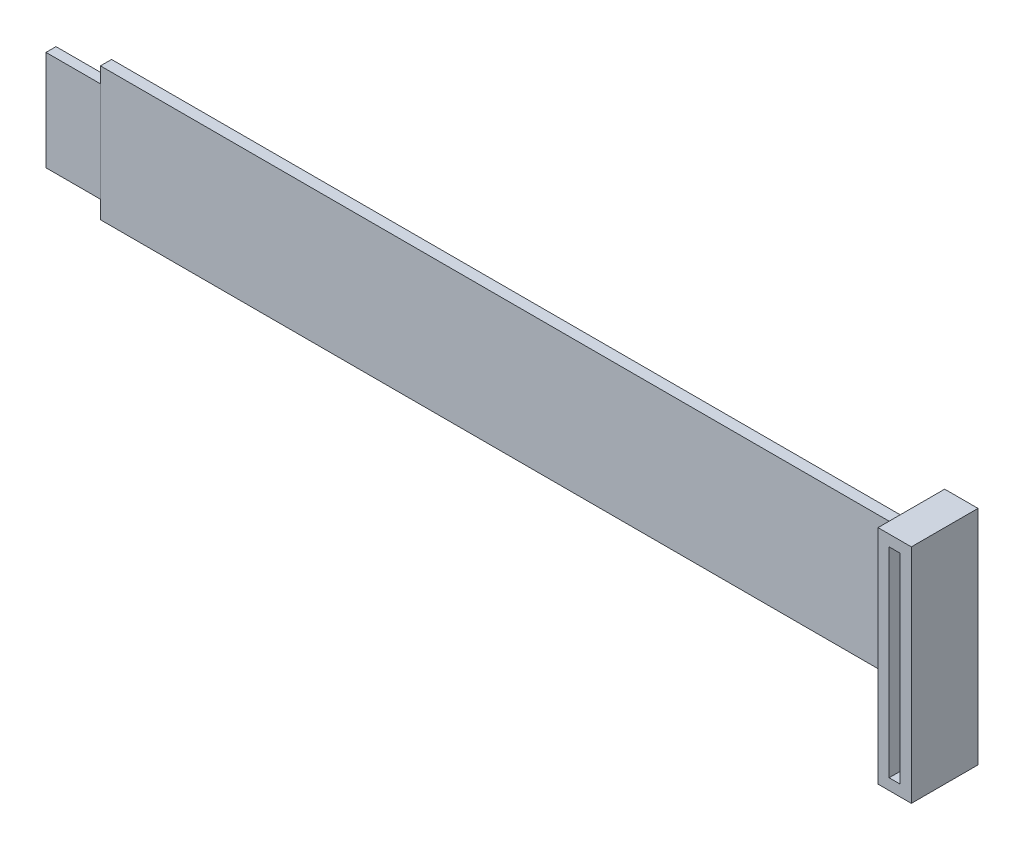
ISO-10303-21;
HEADER;
FILE_DESCRIPTION(('STEP AP214'),'2;1');
FILE_NAME('part.step','',(''),(''),'','','');
FILE_SCHEMA(('AUTOMOTIVE_DESIGN { 1 0 10303 214 1 1 1 1 }'));
ENDSEC;
DATA;
#1=APPLICATION_CONTEXT('core data for automotive mechanical design processes');
#2=APPLICATION_PROTOCOL_DEFINITION('international standard','automotive_design',2000,#1);
#3=PRODUCT_CONTEXT('',#1,'mechanical');
#4=PRODUCT('Part','Part','',(#3));
#5=PRODUCT_RELATED_PRODUCT_CATEGORY('part','',(#4));
#6=PRODUCT_DEFINITION_FORMATION('','',#4);
#7=PRODUCT_DEFINITION_CONTEXT('part definition',#1,'design');
#8=PRODUCT_DEFINITION('design','',#6,#7);
#9=PRODUCT_DEFINITION_SHAPE('','',#8);
#10=(LENGTH_UNIT() NAMED_UNIT(*) SI_UNIT(.MILLI.,.METRE.));
#11=(NAMED_UNIT(*) PLANE_ANGLE_UNIT() SI_UNIT($,.RADIAN.));
#12=(NAMED_UNIT(*) SI_UNIT($,.STERADIAN.) SOLID_ANGLE_UNIT());
#13=UNCERTAINTY_MEASURE_WITH_UNIT(LENGTH_MEASURE(1.E-05),#10,'distance_accuracy_value','');
#14=(GEOMETRIC_REPRESENTATION_CONTEXT(3) GLOBAL_UNCERTAINTY_ASSIGNED_CONTEXT((#13)) GLOBAL_UNIT_ASSIGNED_CONTEXT((#10,
#11,#12)) REPRESENTATION_CONTEXT('',''));
#15=CARTESIAN_POINT('',(0.,0.,0.));
#16=DIRECTION('',(0.,0.,1.));
#17=DIRECTION('',(1.,0.,0.));
#18=AXIS2_PLACEMENT_3D('',#15,#16,#17);
#19=CARTESIAN_POINT('',(0.,0.,2.));
#20=DIRECTION('',(0.,0.,-1.));
#21=DIRECTION('',(-1.,0.,0.));
#22=AXIS2_PLACEMENT_3D('',#19,#20,#21);
#23=PLANE('',#22);
#24=DIRECTION('',(-1.,0.,0.));
#25=VECTOR('',#24,1.);
#26=CARTESIAN_POINT('',(1.48345875234823,3.29589632829374,2.));
#27=LINE('',#26,#25);
#28=CARTESIAN_POINT('',(151.483458752348,3.29589632829374,2.));
#29=VERTEX_POINT('',#28);
#30=CARTESIAN_POINT('',(1.48345875234823,3.29589632829374,2.));
#31=VERTEX_POINT('',#30);
#32=EDGE_CURVE('E291',#29,#31,#27,.T.);
#33=ORIENTED_EDGE('',*,*,#32,.T.);
#34=DIRECTION('',(0.,-1.,0.));
#35=VECTOR('',#34,1.);
#36=CARTESIAN_POINT('',(1.48345875234823,-20.7041036717063,2.));
#37=LINE('',#36,#35);
#38=CARTESIAN_POINT('',(1.48345875234823,-20.7041036717063,2.));
#39=VERTEX_POINT('',#38);
#40=EDGE_CURVE('E303',#31,#39,#37,.T.);
#41=ORIENTED_EDGE('',*,*,#40,.T.);
#42=DIRECTION('',(1.,0.,0.));
#43=VECTOR('',#42,1.);
#44=CARTESIAN_POINT('',(151.483458752348,-20.7041036717063,2.));
#45=LINE('',#44,#43);
#46=CARTESIAN_POINT('',(151.483458752348,-20.7041036717063,2.));
#47=VERTEX_POINT('',#46);
#48=EDGE_CURVE('E294',#39,#47,#45,.T.);
#49=ORIENTED_EDGE('',*,*,#48,.T.);
#50=DIRECTION('',(0.,-1.,0.));
#51=VECTOR('',#50,1.);
#52=CARTESIAN_POINT('',(151.483458752348,3.29589632829374,2.));
#53=LINE('',#52,#51);
#54=EDGE_CURVE('E11',#29,#47,#53,.T.);
#55=ORIENTED_EDGE('',*,*,#54,.F.);
#56=EDGE_LOOP('',(#33,#41,#49,#55));
#57=FACE_BOUND('',#56,.T.);
#58=ADVANCED_FACE('F32',(#57),#23,.F.);
#59=CARTESIAN_POINT('',(-8.51654124765177,1.29589632829374,2.));
#60=DIRECTION('',(1.,0.,0.));
#61=DIRECTION('',(0.,1.,0.));
#62=AXIS2_PLACEMENT_3D('',#59,#60,#61);
#63=PLANE('',#62);
#64=DIRECTION('',(0.,0.,1.));
#65=VECTOR('',#64,1.);
#66=CARTESIAN_POINT('',(-8.51654124765177,-17.7041036717063,0.));
#67=LINE('',#66,#65);
#68=CARTESIAN_POINT('',(-8.51654124765177,-17.7041036717063,0.));
#69=VERTEX_POINT('',#68);
#70=CARTESIAN_POINT('',(-8.51654124765177,-17.7041036717063,1.8));
#71=VERTEX_POINT('',#70);
#72=EDGE_CURVE('E161',#69,#71,#67,.T.);
#73=ORIENTED_EDGE('',*,*,#72,.T.);
#74=DIRECTION('',(0.,-1.,0.));
#75=VECTOR('',#74,1.);
#76=CARTESIAN_POINT('',(-8.51654124765177,0.295896328293736,1.8));
#77=LINE('',#76,#75);
#78=CARTESIAN_POINT('',(-8.51654124765177,0.295896328293736,1.8));
#79=VERTEX_POINT('',#78);
#80=EDGE_CURVE('E48',#79,#71,#77,.T.);
#81=ORIENTED_EDGE('',*,*,#80,.F.);
#82=DIRECTION('',(0.,0.,1.));
#83=VECTOR('',#82,1.);
#84=CARTESIAN_POINT('',(-8.51654124765177,0.295896328293736,0.));
#85=LINE('',#84,#83);
#86=CARTESIAN_POINT('',(-8.51654124765177,0.295896328293736,0.));
#87=VERTEX_POINT('',#86);
#88=EDGE_CURVE('E159',#87,#79,#85,.T.);
#89=ORIENTED_EDGE('',*,*,#88,.F.);
#90=DIRECTION('',(0.,-1.,0.));
#91=VECTOR('',#90,1.);
#92=CARTESIAN_POINT('',(-8.51654124765177,1.29589632829374,0.));
#93=LINE('',#92,#91);
#94=EDGE_CURVE('E237',#87,#69,#93,.T.);
#95=ORIENTED_EDGE('',*,*,#94,.T.);
#96=EDGE_LOOP('',(#73,#81,#89,#95));
#97=FACE_BOUND('',#96,.T.);
#98=ADVANCED_FACE('F34',(#97),#63,.F.);
#99=CARTESIAN_POINT('',(151.483458752348,-20.7041036717063,2.));
#100=DIRECTION('',(0.,1.,0.));
#101=DIRECTION('',(0.,0.,1.));
#102=AXIS2_PLACEMENT_3D('',#99,#100,#101);
#103=PLANE('',#102);
#104=DIRECTION('',(1.,0.,0.));
#105=VECTOR('',#104,1.);
#106=CARTESIAN_POINT('',(151.483458752348,-20.7041036717063,0.));
#107=LINE('',#106,#105);
#108=CARTESIAN_POINT('',(1.48345875234823,-20.7041036717063,0.));
#109=VERTEX_POINT('',#108);
#110=CARTESIAN_POINT('',(151.483458752348,-20.7041036717063,0.));
#111=VERTEX_POINT('',#110);
#112=EDGE_CURVE('E280',#109,#111,#107,.T.);
#113=ORIENTED_EDGE('',*,*,#112,.T.);
#114=DIRECTION('',(0.,0.,-1.));
#115=VECTOR('',#114,1.);
#116=CARTESIAN_POINT('',(151.483458752348,-20.7041036717063,2.));
#117=LINE('',#116,#115);
#118=EDGE_CURVE('E269',#47,#111,#117,.T.);
#119=ORIENTED_EDGE('',*,*,#118,.F.);
#120=ORIENTED_EDGE('',*,*,#48,.F.);
#121=DIRECTION('',(0.,0.,-1.));
#122=VECTOR('',#121,1.);
#123=CARTESIAN_POINT('',(1.48345875234823,-20.7041036717063,2.));
#124=LINE('',#123,#122);
#125=EDGE_CURVE('E41',#39,#109,#124,.T.);
#126=ORIENTED_EDGE('',*,*,#125,.T.);
#127=EDGE_LOOP('',(#113,#119,#120,#126));
#128=FACE_BOUND('',#127,.T.);
#129=ADVANCED_FACE('F312',(#128),#103,.F.);
#130=CARTESIAN_POINT('',(1.48345875234823,3.29589632829374,2.));
#131=DIRECTION('',(0.,-1.,0.));
#132=DIRECTION('',(0.,0.,-1.));
#133=AXIS2_PLACEMENT_3D('',#130,#131,#132);
#134=PLANE('',#133);
#135=DIRECTION('',(-1.,0.,0.));
#136=VECTOR('',#135,1.);
#137=CARTESIAN_POINT('',(1.48345875234823,3.29589632829374,0.));
#138=LINE('',#137,#136);
#139=CARTESIAN_POINT('',(151.483458752348,3.29589632829374,0.));
#140=VERTEX_POINT('',#139);
#141=CARTESIAN_POINT('',(1.48345875234823,3.29589632829374,0.));
#142=VERTEX_POINT('',#141);
#143=EDGE_CURVE('E297',#140,#142,#138,.T.);
#144=ORIENTED_EDGE('',*,*,#143,.T.);
#145=DIRECTION('',(0.,0.,-1.));
#146=VECTOR('',#145,1.);
#147=CARTESIAN_POINT('',(1.48345875234823,3.29589632829374,2.));
#148=LINE('',#147,#146);
#149=EDGE_CURVE('E276',#31,#142,#148,.T.);
#150=ORIENTED_EDGE('',*,*,#149,.F.);
#151=ORIENTED_EDGE('',*,*,#32,.F.);
#152=DIRECTION('',(0.,0.,-1.));
#153=VECTOR('',#152,1.);
#154=CARTESIAN_POINT('',(151.483458752348,3.29589632829374,2.));
#155=LINE('',#154,#153);
#156=EDGE_CURVE('E272',#29,#140,#155,.T.);
#157=ORIENTED_EDGE('',*,*,#156,.T.);
#158=EDGE_LOOP('',(#144,#150,#151,#157));
#159=FACE_BOUND('',#158,.T.);
#160=ADVANCED_FACE('F315',(#159),#134,.F.);
#161=CARTESIAN_POINT('',(1.48345875234823,1.29589632829374,2.));
#162=DIRECTION('',(1.,0.,0.));
#163=DIRECTION('',(0.,0.,-1.));
#164=AXIS2_PLACEMENT_3D('',#161,#162,#163);
#165=PLANE('',#164);
#166=DIRECTION('',(0.,-1.,0.));
#167=VECTOR('',#166,1.);
#168=CARTESIAN_POINT('',(1.48345875234823,1.29589632829374,0.));
#169=LINE('',#168,#167);
#170=CARTESIAN_POINT('',(1.48345875234823,0.295896328293736,0.));
#171=VERTEX_POINT('',#170);
#172=EDGE_CURVE('E298',#142,#171,#169,.T.);
#173=ORIENTED_EDGE('',*,*,#172,.T.);
#174=DIRECTION('',(0.,0.,1.));
#175=VECTOR('',#174,1.);
#176=CARTESIAN_POINT('',(1.48345875234823,0.295896328293736,0.));
#177=LINE('',#176,#175);
#178=CARTESIAN_POINT('',(1.48345875234823,0.295896328293736,1.8));
#179=VERTEX_POINT('',#178);
#180=EDGE_CURVE('E166',#171,#179,#177,.T.);
#181=ORIENTED_EDGE('',*,*,#180,.T.);
#182=DIRECTION('',(0.,-1.,0.));
#183=VECTOR('',#182,1.);
#184=CARTESIAN_POINT('',(1.48345875234823,0.295896328293736,1.8));
#185=LINE('',#184,#183);
#186=CARTESIAN_POINT('',(1.48345875234823,-17.7041036717063,1.8));
#187=VERTEX_POINT('',#186);
#188=EDGE_CURVE('E148',#179,#187,#185,.T.);
#189=ORIENTED_EDGE('',*,*,#188,.T.);
#190=DIRECTION('',(0.,0.,1.));
#191=VECTOR('',#190,1.);
#192=CARTESIAN_POINT('',(1.48345875234823,-17.7041036717063,0.));
#193=LINE('',#192,#191);
#194=CARTESIAN_POINT('',(1.48345875234823,-17.7041036717063,0.));
#195=VERTEX_POINT('',#194);
#196=EDGE_CURVE('E525',#195,#187,#193,.T.);
#197=ORIENTED_EDGE('',*,*,#196,.F.);
#198=DIRECTION('',(0.,-1.,0.));
#199=VECTOR('',#198,1.);
#200=CARTESIAN_POINT('',(1.48345875234823,-20.7041036717063,0.));
#201=LINE('',#200,#199);
#202=EDGE_CURVE('E56',#195,#109,#201,.T.);
#203=ORIENTED_EDGE('',*,*,#202,.T.);
#204=ORIENTED_EDGE('',*,*,#125,.F.);
#205=ORIENTED_EDGE('',*,*,#40,.F.);
#206=ORIENTED_EDGE('',*,*,#149,.T.);
#207=EDGE_LOOP('',(#173,#181,#189,#197,#203,#204,#205,#206));
#208=FACE_BOUND('',#207,.T.);
#209=ADVANCED_FACE('F313',(#208),#165,.F.);
#210=CARTESIAN_POINT('',(0.,0.,0.));
#211=DIRECTION('',(0.,0.,-1.));
#212=DIRECTION('',(-1.,0.,0.));
#213=AXIS2_PLACEMENT_3D('',#210,#211,#212);
#214=PLANE('',#213);
#215=DIRECTION('',(-1.,0.,0.));
#216=VECTOR('',#215,1.);
#217=CARTESIAN_POINT('',(-8.51654124765177,-17.7041036717063,0.));
#218=LINE('',#217,#216);
#219=EDGE_CURVE('E526',#195,#69,#218,.T.);
#220=ORIENTED_EDGE('',*,*,#219,.T.);
#221=ORIENTED_EDGE('',*,*,#94,.F.);
#222=DIRECTION('',(1.,0.,0.));
#223=VECTOR('',#222,1.);
#224=CARTESIAN_POINT('',(-8.51654124765177,0.295896328293736,0.));
#225=LINE('',#224,#223);
#226=EDGE_CURVE('E165',#87,#171,#225,.T.);
#227=ORIENTED_EDGE('',*,*,#226,.T.);
#228=ORIENTED_EDGE('',*,*,#172,.F.);
#229=ORIENTED_EDGE('',*,*,#143,.F.);
#230=DIRECTION('',(0.,-1.,0.));
#231=VECTOR('',#230,1.);
#232=CARTESIAN_POINT('',(151.483458752348,-28.7041036717063,0.));
#233=LINE('',#232,#231);
#234=CARTESIAN_POINT('',(151.483458752348,11.2958963282937,0.));
#235=VERTEX_POINT('',#234);
#236=EDGE_CURVE('E225',#235,#140,#233,.T.);
#237=ORIENTED_EDGE('',*,*,#236,.F.);
#238=DIRECTION('',(-1.,0.,0.));
#239=VECTOR('',#238,1.);
#240=CARTESIAN_POINT('',(151.483458752348,11.2958963282937,0.));
#241=LINE('',#240,#239);
#242=CARTESIAN_POINT('',(157.483458752348,11.2958963282937,0.));
#243=VERTEX_POINT('',#242);
#244=EDGE_CURVE('E231',#243,#235,#241,.T.);
#245=ORIENTED_EDGE('',*,*,#244,.F.);
#246=DIRECTION('',(0.,1.,0.));
#247=VECTOR('',#246,1.);
#248=CARTESIAN_POINT('',(157.483458752348,11.2958963282937,0.));
#249=LINE('',#248,#247);
#250=CARTESIAN_POINT('',(157.483458752348,-28.7041036717063,0.));
#251=VERTEX_POINT('',#250);
#252=EDGE_CURVE('E239',#251,#243,#249,.T.);
#253=ORIENTED_EDGE('',*,*,#252,.F.);
#254=DIRECTION('',(1.,0.,0.));
#255=VECTOR('',#254,1.);
#256=CARTESIAN_POINT('',(157.483458752348,-28.7041036717063,0.));
#257=LINE('',#256,#255);
#258=CARTESIAN_POINT('',(151.483458752348,-28.7041036717063,0.));
#259=VERTEX_POINT('',#258);
#260=EDGE_CURVE('E219',#259,#251,#257,.T.);
#261=ORIENTED_EDGE('',*,*,#260,.F.);
#262=EDGE_CURVE('E211',#111,#259,#233,.T.);
#263=ORIENTED_EDGE('',*,*,#262,.F.);
#264=ORIENTED_EDGE('',*,*,#112,.F.);
#265=ORIENTED_EDGE('',*,*,#202,.F.);
#266=EDGE_LOOP('',(#220,#221,#227,#228,#229,#237,#245,#253,#261,#263,#264,#265));
#267=FACE_BOUND('',#266,.T.);
#268=DIRECTION('',(0.,-1.,0.));
#269=VECTOR('',#268,1.);
#270=CARTESIAN_POINT('',(153.483458752348,9.29589632829374,0.));
#271=LINE('',#270,#269);
#272=CARTESIAN_POINT('',(153.483458752348,9.29589632829374,0.));
#273=VERTEX_POINT('',#272);
#274=CARTESIAN_POINT('',(153.483458752348,-26.7041036717063,0.));
#275=VERTEX_POINT('',#274);
#276=EDGE_CURVE('E194',#273,#275,#271,.T.);
#277=ORIENTED_EDGE('',*,*,#276,.T.);
#278=DIRECTION('',(1.,0.,0.));
#279=VECTOR('',#278,1.);
#280=CARTESIAN_POINT('',(153.483458752348,-26.7041036717063,0.));
#281=LINE('',#280,#279);
#282=CARTESIAN_POINT('',(155.483458752348,-26.7041036717063,0.));
#283=VERTEX_POINT('',#282);
#284=EDGE_CURVE('E199',#275,#283,#281,.T.);
#285=ORIENTED_EDGE('',*,*,#284,.T.);
#286=DIRECTION('',(0.,1.,0.));
#287=VECTOR('',#286,1.);
#288=CARTESIAN_POINT('',(155.483458752348,9.29589632829374,0.));
#289=LINE('',#288,#287);
#290=CARTESIAN_POINT('',(155.483458752348,9.29589632829374,0.));
#291=VERTEX_POINT('',#290);
#292=EDGE_CURVE('E202',#283,#291,#289,.T.);
#293=ORIENTED_EDGE('',*,*,#292,.T.);
#294=DIRECTION('',(-1.,0.,0.));
#295=VECTOR('',#294,1.);
#296=CARTESIAN_POINT('',(153.483458752348,9.29589632829374,0.));
#297=LINE('',#296,#295);
#298=EDGE_CURVE('E205',#291,#273,#297,.T.);
#299=ORIENTED_EDGE('',*,*,#298,.T.);
#300=EDGE_LOOP('',(#277,#285,#293,#299));
#301=FACE_BOUND('',#300,.T.);
#302=ADVANCED_FACE('F250',(#267,#301),#214,.T.);
#303=CARTESIAN_POINT('',(151.483458752348,3.29589632829374,0.));
#304=DIRECTION('',(-1.,0.,0.));
#305=DIRECTION('',(0.,0.,1.));
#306=AXIS2_PLACEMENT_3D('',#303,#304,#305);
#307=PLANE('',#306);
#308=ORIENTED_EDGE('',*,*,#156,.F.);
#309=ORIENTED_EDGE('',*,*,#54,.T.);
#310=ORIENTED_EDGE('',*,*,#118,.T.);
#311=ORIENTED_EDGE('',*,*,#262,.T.);
#312=DIRECTION('',(0.,0.,1.));
#313=VECTOR('',#312,1.);
#314=CARTESIAN_POINT('',(151.483458752348,-28.7041036717063,0.));
#315=LINE('',#314,#313);
#316=CARTESIAN_POINT('',(151.483458752348,-28.7041036717063,12.));
#317=VERTEX_POINT('',#316);
#318=EDGE_CURVE('E228',#259,#317,#315,.T.);
#319=ORIENTED_EDGE('',*,*,#318,.T.);
#320=DIRECTION('',(0.,-1.,0.));
#321=VECTOR('',#320,1.);
#322=CARTESIAN_POINT('',(151.483458752348,-28.7041036717063,12.));
#323=LINE('',#322,#321);
#324=CARTESIAN_POINT('',(151.483458752348,11.2958963282937,12.));
#325=VERTEX_POINT('',#324);
#326=EDGE_CURVE('E183',#325,#317,#323,.T.);
#327=ORIENTED_EDGE('',*,*,#326,.F.);
#328=DIRECTION('',(0.,0.,1.));
#329=VECTOR('',#328,1.);
#330=CARTESIAN_POINT('',(151.483458752348,11.2958963282937,0.));
#331=LINE('',#330,#329);
#332=EDGE_CURVE('E235',#235,#325,#331,.T.);
#333=ORIENTED_EDGE('',*,*,#332,.F.);
#334=ORIENTED_EDGE('',*,*,#236,.T.);
#335=EDGE_LOOP('',(#308,#309,#310,#311,#319,#327,#333,#334));
#336=FACE_BOUND('',#335,.T.);
#337=ADVANCED_FACE('F266',(#336),#307,.T.);
#338=CARTESIAN_POINT('',(151.483458752348,11.2958963282937,0.));
#339=DIRECTION('',(0.,1.,0.));
#340=DIRECTION('',(0.,0.,1.));
#341=AXIS2_PLACEMENT_3D('',#338,#339,#340);
#342=PLANE('',#341);
#343=ORIENTED_EDGE('',*,*,#332,.T.);
#344=DIRECTION('',(-1.,0.,0.));
#345=VECTOR('',#344,1.);
#346=CARTESIAN_POINT('',(151.483458752348,11.2958963282937,12.));
#347=LINE('',#346,#345);
#348=CARTESIAN_POINT('',(157.483458752348,11.2958963282937,12.));
#349=VERTEX_POINT('',#348);
#350=EDGE_CURVE('E192',#349,#325,#347,.T.);
#351=ORIENTED_EDGE('',*,*,#350,.F.);
#352=DIRECTION('',(0.,0.,1.));
#353=VECTOR('',#352,1.);
#354=CARTESIAN_POINT('',(157.483458752348,11.2958963282937,0.));
#355=LINE('',#354,#353);
#356=EDGE_CURVE('E233',#243,#349,#355,.T.);
#357=ORIENTED_EDGE('',*,*,#356,.F.);
#358=ORIENTED_EDGE('',*,*,#244,.T.);
#359=EDGE_LOOP('',(#343,#351,#357,#358));
#360=FACE_BOUND('',#359,.T.);
#361=ADVANCED_FACE('F256',(#360),#342,.T.);
#362=CARTESIAN_POINT('',(157.483458752348,11.2958963282937,0.));
#363=DIRECTION('',(1.,0.,0.));
#364=DIRECTION('',(0.,0.,-1.));
#365=AXIS2_PLACEMENT_3D('',#362,#363,#364);
#366=PLANE('',#365);
#367=ORIENTED_EDGE('',*,*,#356,.T.);
#368=DIRECTION('',(0.,1.,0.));
#369=VECTOR('',#368,1.);
#370=CARTESIAN_POINT('',(157.483458752348,11.2958963282937,12.));
#371=LINE('',#370,#369);
#372=CARTESIAN_POINT('',(157.483458752348,-28.7041036717063,12.));
#373=VERTEX_POINT('',#372);
#374=EDGE_CURVE('E189',#373,#349,#371,.T.);
#375=ORIENTED_EDGE('',*,*,#374,.F.);
#376=DIRECTION('',(0.,0.,1.));
#377=VECTOR('',#376,1.);
#378=CARTESIAN_POINT('',(157.483458752348,-28.7041036717063,0.));
#379=LINE('',#378,#377);
#380=EDGE_CURVE('E230',#251,#373,#379,.T.);
#381=ORIENTED_EDGE('',*,*,#380,.F.);
#382=ORIENTED_EDGE('',*,*,#252,.T.);
#383=EDGE_LOOP('',(#367,#375,#381,#382));
#384=FACE_BOUND('',#383,.T.);
#385=ADVANCED_FACE('F260',(#384),#366,.T.);
#386=CARTESIAN_POINT('',(157.483458752348,-28.7041036717063,0.));
#387=DIRECTION('',(0.,-1.,0.));
#388=DIRECTION('',(0.,0.,-1.));
#389=AXIS2_PLACEMENT_3D('',#386,#387,#388);
#390=PLANE('',#389);
#391=ORIENTED_EDGE('',*,*,#380,.T.);
#392=DIRECTION('',(1.,0.,0.));
#393=VECTOR('',#392,1.);
#394=CARTESIAN_POINT('',(157.483458752348,-28.7041036717063,12.));
#395=LINE('',#394,#393);
#396=EDGE_CURVE('E186',#317,#373,#395,.T.);
#397=ORIENTED_EDGE('',*,*,#396,.F.);
#398=ORIENTED_EDGE('',*,*,#318,.F.);
#399=ORIENTED_EDGE('',*,*,#260,.T.);
#400=EDGE_LOOP('',(#391,#397,#398,#399));
#401=FACE_BOUND('',#400,.T.);
#402=ADVANCED_FACE('F247',(#401),#390,.T.);
#403=CARTESIAN_POINT('',(153.483458752348,9.29589632829374,0.));
#404=DIRECTION('',(-1.,0.,0.));
#405=DIRECTION('',(0.,0.,1.));
#406=AXIS2_PLACEMENT_3D('',#403,#404,#405);
#407=PLANE('',#406);
#408=DIRECTION('',(0.,0.,1.));
#409=VECTOR('',#408,1.);
#410=CARTESIAN_POINT('',(153.483458752348,9.29589632829374,0.));
#411=LINE('',#410,#409);
#412=CARTESIAN_POINT('',(153.483458752348,9.29589632829374,12.));
#413=VERTEX_POINT('',#412);
#414=EDGE_CURVE('E209',#273,#413,#411,.T.);
#415=ORIENTED_EDGE('',*,*,#414,.T.);
#416=DIRECTION('',(0.,-1.,0.));
#417=VECTOR('',#416,1.);
#418=CARTESIAN_POINT('',(153.483458752348,9.29589632829374,12.));
#419=LINE('',#418,#417);
#420=CARTESIAN_POINT('',(153.483458752348,-26.7041036717063,12.));
#421=VERTEX_POINT('',#420);
#422=EDGE_CURVE('E168',#413,#421,#419,.T.);
#423=ORIENTED_EDGE('',*,*,#422,.T.);
#424=DIRECTION('',(0.,0.,1.));
#425=VECTOR('',#424,1.);
#426=CARTESIAN_POINT('',(153.483458752348,-26.7041036717063,0.));
#427=LINE('',#426,#425);
#428=EDGE_CURVE('E208',#275,#421,#427,.T.);
#429=ORIENTED_EDGE('',*,*,#428,.F.);
#430=ORIENTED_EDGE('',*,*,#276,.F.);
#431=EDGE_LOOP('',(#415,#423,#429,#430));
#432=FACE_BOUND('',#431,.T.);
#433=ADVANCED_FACE('F342',(#432),#407,.F.);
#434=CARTESIAN_POINT('',(153.483458752348,9.29589632829374,0.));
#435=DIRECTION('',(0.,1.,0.));
#436=DIRECTION('',(0.,0.,1.));
#437=AXIS2_PLACEMENT_3D('',#434,#435,#436);
#438=PLANE('',#437);
#439=DIRECTION('',(0.,0.,1.));
#440=VECTOR('',#439,1.);
#441=CARTESIAN_POINT('',(155.483458752348,9.29589632829374,0.));
#442=LINE('',#441,#440);
#443=CARTESIAN_POINT('',(155.483458752348,9.29589632829374,12.));
#444=VERTEX_POINT('',#443);
#445=EDGE_CURVE('E212',#291,#444,#442,.T.);
#446=ORIENTED_EDGE('',*,*,#445,.T.);
#447=DIRECTION('',(-1.,0.,0.));
#448=VECTOR('',#447,1.);
#449=CARTESIAN_POINT('',(153.483458752348,9.29589632829374,12.));
#450=LINE('',#449,#448);
#451=EDGE_CURVE('E180',#444,#413,#450,.T.);
#452=ORIENTED_EDGE('',*,*,#451,.T.);
#453=ORIENTED_EDGE('',*,*,#414,.F.);
#454=ORIENTED_EDGE('',*,*,#298,.F.);
#455=EDGE_LOOP('',(#446,#452,#453,#454));
#456=FACE_BOUND('',#455,.T.);
#457=ADVANCED_FACE('F351',(#456),#438,.F.);
#458=CARTESIAN_POINT('',(155.483458752348,9.29589632829374,0.));
#459=DIRECTION('',(1.,0.,0.));
#460=DIRECTION('',(0.,0.,-1.));
#461=AXIS2_PLACEMENT_3D('',#458,#459,#460);
#462=PLANE('',#461);
#463=DIRECTION('',(0.,0.,1.));
#464=VECTOR('',#463,1.);
#465=CARTESIAN_POINT('',(155.483458752348,-26.7041036717063,0.));
#466=LINE('',#465,#464);
#467=CARTESIAN_POINT('',(155.483458752348,-26.7041036717063,12.));
#468=VERTEX_POINT('',#467);
#469=EDGE_CURVE('E214',#283,#468,#466,.T.);
#470=ORIENTED_EDGE('',*,*,#469,.T.);
#471=DIRECTION('',(0.,1.,0.));
#472=VECTOR('',#471,1.);
#473=CARTESIAN_POINT('',(155.483458752348,9.29589632829374,12.));
#474=LINE('',#473,#472);
#475=EDGE_CURVE('E177',#468,#444,#474,.T.);
#476=ORIENTED_EDGE('',*,*,#475,.T.);
#477=ORIENTED_EDGE('',*,*,#445,.F.);
#478=ORIENTED_EDGE('',*,*,#292,.F.);
#479=EDGE_LOOP('',(#470,#476,#477,#478));
#480=FACE_BOUND('',#479,.T.);
#481=ADVANCED_FACE('F356',(#480),#462,.F.);
#482=CARTESIAN_POINT('',(153.483458752348,-26.7041036717063,0.));
#483=DIRECTION('',(0.,-1.,0.));
#484=DIRECTION('',(0.,0.,-1.));
#485=AXIS2_PLACEMENT_3D('',#482,#483,#484);
#486=PLANE('',#485);
#487=ORIENTED_EDGE('',*,*,#428,.T.);
#488=DIRECTION('',(1.,0.,0.));
#489=VECTOR('',#488,1.);
#490=CARTESIAN_POINT('',(153.483458752348,-26.7041036717063,12.));
#491=LINE('',#490,#489);
#492=EDGE_CURVE('E174',#421,#468,#491,.T.);
#493=ORIENTED_EDGE('',*,*,#492,.T.);
#494=ORIENTED_EDGE('',*,*,#469,.F.);
#495=ORIENTED_EDGE('',*,*,#284,.F.);
#496=EDGE_LOOP('',(#487,#493,#494,#495));
#497=FACE_BOUND('',#496,.T.);
#498=ADVANCED_FACE('F367',(#497),#486,.F.);
#499=CARTESIAN_POINT('',(0.,0.,12.));
#500=DIRECTION('',(0.,0.,-1.));
#501=DIRECTION('',(-1.,0.,0.));
#502=AXIS2_PLACEMENT_3D('',#499,#500,#501);
#503=PLANE('',#502);
#504=ORIENTED_EDGE('',*,*,#326,.T.);
#505=ORIENTED_EDGE('',*,*,#396,.T.);
#506=ORIENTED_EDGE('',*,*,#374,.T.);
#507=ORIENTED_EDGE('',*,*,#350,.T.);
#508=EDGE_LOOP('',(#504,#505,#506,#507));
#509=FACE_BOUND('',#508,.T.);
#510=ORIENTED_EDGE('',*,*,#422,.F.);
#511=ORIENTED_EDGE('',*,*,#451,.F.);
#512=ORIENTED_EDGE('',*,*,#475,.F.);
#513=ORIENTED_EDGE('',*,*,#492,.F.);
#514=EDGE_LOOP('',(#510,#511,#512,#513));
#515=FACE_BOUND('',#514,.T.);
#516=ADVANCED_FACE('F262',(#509,#515),#503,.F.);
#517=CARTESIAN_POINT('',(-8.51654124765177,0.295896328293736,0.));
#518=DIRECTION('',(0.,-1.,0.));
#519=DIRECTION('',(0.,0.,-1.));
#520=AXIS2_PLACEMENT_3D('',#517,#518,#519);
#521=PLANE('',#520);
#522=ORIENTED_EDGE('',*,*,#88,.T.);
#523=DIRECTION('',(1.,0.,0.));
#524=VECTOR('',#523,1.);
#525=CARTESIAN_POINT('',(-8.51654124765177,0.295896328293736,1.8));
#526=LINE('',#525,#524);
#527=EDGE_CURVE('E146',#79,#179,#526,.T.);
#528=ORIENTED_EDGE('',*,*,#527,.T.);
#529=ORIENTED_EDGE('',*,*,#180,.F.);
#530=ORIENTED_EDGE('',*,*,#226,.F.);
#531=EDGE_LOOP('',(#522,#528,#529,#530));
#532=FACE_BOUND('',#531,.T.);
#533=ADVANCED_FACE('F163',(#532),#521,.F.);
#534=CARTESIAN_POINT('',(-8.51654124765177,-17.7041036717063,0.));
#535=DIRECTION('',(0.,1.,0.));
#536=DIRECTION('',(0.,0.,1.));
#537=AXIS2_PLACEMENT_3D('',#534,#535,#536);
#538=PLANE('',#537);
#539=ORIENTED_EDGE('',*,*,#196,.T.);
#540=DIRECTION('',(1.,0.,0.));
#541=VECTOR('',#540,1.);
#542=CARTESIAN_POINT('',(-8.51654124765177,-17.7041036717063,1.8));
#543=LINE('',#542,#541);
#544=EDGE_CURVE('E153',#71,#187,#543,.T.);
#545=ORIENTED_EDGE('',*,*,#544,.F.);
#546=ORIENTED_EDGE('',*,*,#72,.F.);
#547=ORIENTED_EDGE('',*,*,#219,.F.);
#548=EDGE_LOOP('',(#539,#545,#546,#547));
#549=FACE_BOUND('',#548,.T.);
#550=ADVANCED_FACE('F380',(#549),#538,.F.);
#551=CARTESIAN_POINT('',(-8.51654124765177,0.295896328293736,1.8));
#552=DIRECTION('',(0.,0.,-1.));
#553=DIRECTION('',(-1.,0.,0.));
#554=AXIS2_PLACEMENT_3D('',#551,#552,#553);
#555=PLANE('',#554);
#556=ORIENTED_EDGE('',*,*,#544,.T.);
#557=ORIENTED_EDGE('',*,*,#188,.F.);
#558=ORIENTED_EDGE('',*,*,#527,.F.);
#559=ORIENTED_EDGE('',*,*,#80,.T.);
#560=EDGE_LOOP('',(#556,#557,#558,#559));
#561=FACE_BOUND('',#560,.T.);
#562=ADVANCED_FACE('F147',(#561),#555,.F.);
#563=CLOSED_SHELL('',(#58,#98,#129,#160,#209,#302,#337,#361,#385,#402,#433,#457,#481,#498,#516,
#533,#550,#562));
#564=MANIFOLD_SOLID_BREP('B2',#563);
#565=ADVANCED_BREP_SHAPE_REPRESENTATION('',(#18,#564),#14);
#566=SHAPE_DEFINITION_REPRESENTATION(#9,#565);
ENDSEC;
END-ISO-10303-21;
